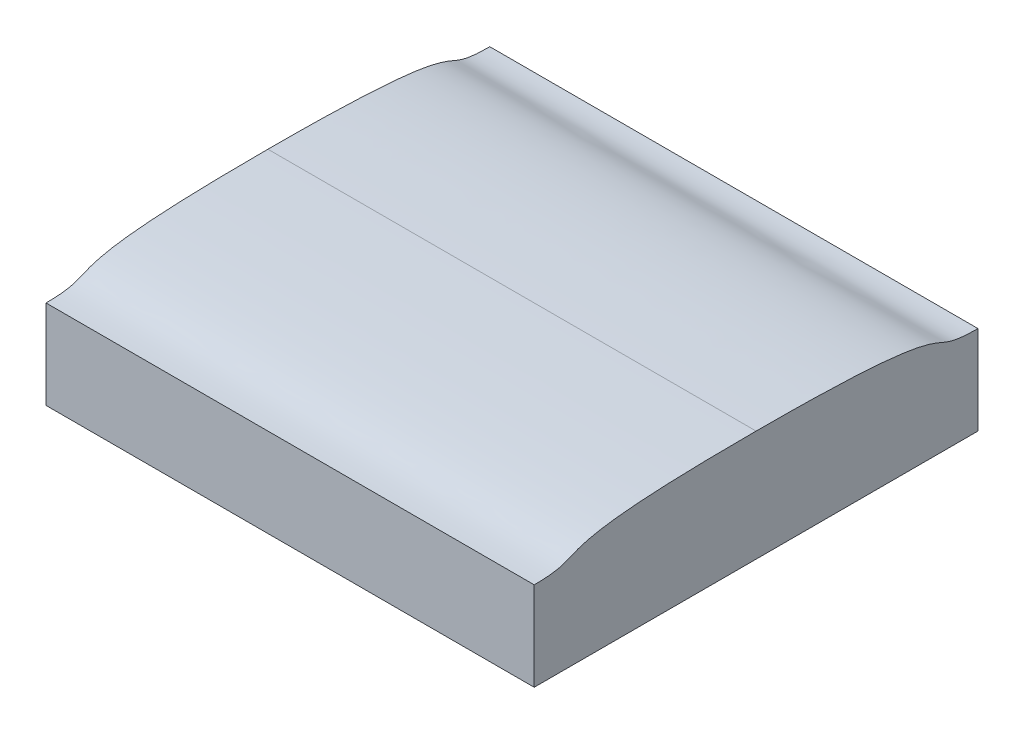
ISO-10303-21;
HEADER;
FILE_DESCRIPTION(('STEP AP214'),'2;1');
FILE_NAME('part.step','',(''),(''),'','','');
FILE_SCHEMA(('AUTOMOTIVE_DESIGN { 1 0 10303 214 1 1 1 1 }'));
ENDSEC;
DATA;
#1=APPLICATION_CONTEXT('core data for automotive mechanical design processes');
#2=APPLICATION_PROTOCOL_DEFINITION('international standard','automotive_design',2000,#1);
#3=PRODUCT_CONTEXT('',#1,'mechanical');
#4=PRODUCT('Part','Part','',(#3));
#5=PRODUCT_RELATED_PRODUCT_CATEGORY('part','',(#4));
#6=PRODUCT_DEFINITION_FORMATION('','',#4);
#7=PRODUCT_DEFINITION_CONTEXT('part definition',#1,'design');
#8=PRODUCT_DEFINITION('design','',#6,#7);
#9=PRODUCT_DEFINITION_SHAPE('','',#8);
#10=(LENGTH_UNIT() NAMED_UNIT(*) SI_UNIT(.MILLI.,.METRE.));
#11=(NAMED_UNIT(*) PLANE_ANGLE_UNIT() SI_UNIT($,.RADIAN.));
#12=(NAMED_UNIT(*) SI_UNIT($,.STERADIAN.) SOLID_ANGLE_UNIT());
#13=UNCERTAINTY_MEASURE_WITH_UNIT(LENGTH_MEASURE(1.E-05),#10,'distance_accuracy_value','');
#14=(GEOMETRIC_REPRESENTATION_CONTEXT(3) GLOBAL_UNCERTAINTY_ASSIGNED_CONTEXT((#13)) GLOBAL_UNIT_ASSIGNED_CONTEXT((#10,
#11,#12)) REPRESENTATION_CONTEXT('',''));
#15=CARTESIAN_POINT('',(0.,0.,0.));
#16=DIRECTION('',(0.,0.,1.));
#17=DIRECTION('',(1.,0.,0.));
#18=AXIS2_PLACEMENT_3D('',#15,#16,#17);
#19=CARTESIAN_POINT('',(22.,-0.230657832531694,-10.));
#20=DIRECTION('',(0.,0.,1.));
#21=DIRECTION('',(0.,-1.,0.));
#22=AXIS2_PLACEMENT_3D('',#19,#20,#21);
#23=PLANE('',#22);
#24=DIRECTION('',(0.,1.,0.));
#25=VECTOR('',#24,1.);
#26=CARTESIAN_POINT('',(0.,-0.230657832531694,-10.));
#27=LINE('',#26,#25);
#28=CARTESIAN_POINT('',(0.,-0.230657832531694,-10.));
#29=VERTEX_POINT('',#28);
#30=CARTESIAN_POINT('',(0.,3.76934216746831,-10.));
#31=VERTEX_POINT('',#30);
#32=EDGE_CURVE('E129',#29,#31,#27,.T.);
#33=ORIENTED_EDGE('',*,*,#32,.T.);
#34=DIRECTION('',(-1.,0.,0.));
#35=VECTOR('',#34,1.);
#36=CARTESIAN_POINT('',(22.,3.76934216746831,-10.));
#37=LINE('',#36,#35);
#38=CARTESIAN_POINT('',(22.,3.76934216746831,-10.));
#39=VERTEX_POINT('',#38);
#40=EDGE_CURVE('E41',#39,#31,#37,.T.);
#41=ORIENTED_EDGE('',*,*,#40,.F.);
#42=DIRECTION('',(0.,1.,0.));
#43=VECTOR('',#42,1.);
#44=CARTESIAN_POINT('',(22.,-0.230657832531694,-10.));
#45=LINE('',#44,#43);
#46=CARTESIAN_POINT('',(22.,-0.230657832531694,-10.));
#47=VERTEX_POINT('',#46);
#48=EDGE_CURVE('E87',#47,#39,#45,.T.);
#49=ORIENTED_EDGE('',*,*,#48,.F.);
#50=DIRECTION('',(-1.,0.,0.));
#51=VECTOR('',#50,1.);
#52=CARTESIAN_POINT('',(22.,-0.230657832531694,-10.));
#53=LINE('',#52,#51);
#54=EDGE_CURVE('E11',#47,#29,#53,.T.);
#55=ORIENTED_EDGE('',*,*,#54,.T.);
#56=EDGE_LOOP('',(#33,#41,#49,#55));
#57=FACE_BOUND('',#56,.T.);
#58=ADVANCED_FACE('F33',(#57),#23,.F.);
#59=CARTESIAN_POINT('',(22.,3.76934216746831,-10.));
#60=CARTESIAN_POINT('',(22.,3.76934216746831,-7.16012925192827));
#61=CARTESIAN_POINT('',(22.,4.76934216746831,-10.1680616594772));
#62=CARTESIAN_POINT('',(22.,4.76934216746831,0.));
#63=B_SPLINE_CURVE_WITH_KNOTS('',3,(#59,#60,#61,#62),.UNSPECIFIED.,.F.,.F.,(4,4),(0.,1.),.UNSPECIFIED.);
#64=DIRECTION('',(-1.,0.,0.));
#65=VECTOR('',#64,1.);
#66=SURFACE_OF_LINEAR_EXTRUSION('',#63,#65);
#67=CARTESIAN_POINT('',(0.,3.76934216746831,-10.));
#68=CARTESIAN_POINT('',(0.,3.76934216746831,-7.16012925192827));
#69=CARTESIAN_POINT('',(0.,4.76934216746831,-10.1680616594772));
#70=CARTESIAN_POINT('',(0.,4.76934216746831,0.));
#71=B_SPLINE_CURVE_WITH_KNOTS('',3,(#67,#68,#69,#70),.UNSPECIFIED.,.F.,.F.,(4,4),(0.,1.),.UNSPECIFIED.);
#72=CARTESIAN_POINT('',(0.,4.76934216746831,0.));
#73=VERTEX_POINT('',#72);
#74=EDGE_CURVE('E134',#31,#73,#71,.T.);
#75=ORIENTED_EDGE('',*,*,#74,.T.);
#76=DIRECTION('',(-1.,0.,0.));
#77=VECTOR('',#76,1.);
#78=CARTESIAN_POINT('',(22.,4.76934216746831,0.));
#79=LINE('',#78,#77);
#80=CARTESIAN_POINT('',(22.,4.76934216746831,0.));
#81=VERTEX_POINT('',#80);
#82=EDGE_CURVE('E109',#81,#73,#79,.T.);
#83=ORIENTED_EDGE('',*,*,#82,.F.);
#84=EDGE_CURVE('E100',#39,#81,#63,.T.);
#85=ORIENTED_EDGE('',*,*,#84,.F.);
#86=ORIENTED_EDGE('',*,*,#40,.T.);
#87=EDGE_LOOP('',(#75,#83,#85,#86));
#88=FACE_BOUND('',#87,.T.);
#89=ADVANCED_FACE('F159',(#88),#66,.F.);
#90=CARTESIAN_POINT('',(22.,4.76934216746831,0.));
#91=CARTESIAN_POINT('',(22.,4.76934216746831,10.1680616594772));
#92=CARTESIAN_POINT('',(22.,3.76934216746831,7.16012925192827));
#93=CARTESIAN_POINT('',(22.,3.76934216746831,10.));
#94=B_SPLINE_CURVE_WITH_KNOTS('',3,(#90,#91,#92,#93),.UNSPECIFIED.,.F.,.F.,(4,4),(0.,1.),.UNSPECIFIED.);
#95=DIRECTION('',(-1.,0.,0.));
#96=VECTOR('',#95,1.);
#97=SURFACE_OF_LINEAR_EXTRUSION('',#94,#96);
#98=CARTESIAN_POINT('',(0.,4.76934216746831,0.));
#99=CARTESIAN_POINT('',(0.,4.76934216746831,10.1680616594772));
#100=CARTESIAN_POINT('',(0.,3.76934216746831,7.16012925192827));
#101=CARTESIAN_POINT('',(0.,3.76934216746831,10.));
#102=B_SPLINE_CURVE_WITH_KNOTS('',3,(#98,#99,#100,#101),.UNSPECIFIED.,.F.,.F.,(4,4),(0.,1.),.UNSPECIFIED.);
#103=CARTESIAN_POINT('',(0.,3.76934216746831,10.));
#104=VERTEX_POINT('',#103);
#105=EDGE_CURVE('E108',#73,#104,#102,.T.);
#106=ORIENTED_EDGE('',*,*,#105,.T.);
#107=DIRECTION('',(-1.,0.,0.));
#108=VECTOR('',#107,1.);
#109=CARTESIAN_POINT('',(22.,3.76934216746831,10.));
#110=LINE('',#109,#108);
#111=CARTESIAN_POINT('',(22.,3.76934216746831,10.));
#112=VERTEX_POINT('',#111);
#113=EDGE_CURVE('E105',#112,#104,#110,.T.);
#114=ORIENTED_EDGE('',*,*,#113,.F.);
#115=EDGE_CURVE('E94',#81,#112,#94,.T.);
#116=ORIENTED_EDGE('',*,*,#115,.F.);
#117=ORIENTED_EDGE('',*,*,#82,.T.);
#118=EDGE_LOOP('',(#106,#114,#116,#117));
#119=FACE_BOUND('',#118,.T.);
#120=ADVANCED_FACE('F106',(#119),#97,.F.);
#121=CARTESIAN_POINT('',(22.,-0.230657832531694,10.));
#122=DIRECTION('',(0.,0.,-1.));
#123=DIRECTION('',(0.,1.,0.));
#124=AXIS2_PLACEMENT_3D('',#121,#122,#123);
#125=PLANE('',#124);
#126=DIRECTION('',(0.,-1.,0.));
#127=VECTOR('',#126,1.);
#128=CARTESIAN_POINT('',(0.,-0.230657832531694,10.));
#129=LINE('',#128,#127);
#130=CARTESIAN_POINT('',(0.,-0.230657832531694,10.));
#131=VERTEX_POINT('',#130);
#132=EDGE_CURVE('E72',#104,#131,#129,.T.);
#133=ORIENTED_EDGE('',*,*,#132,.T.);
#134=DIRECTION('',(-1.,0.,0.));
#135=VECTOR('',#134,1.);
#136=CARTESIAN_POINT('',(22.,-0.230657832531694,10.));
#137=LINE('',#136,#135);
#138=CARTESIAN_POINT('',(22.,-0.230657832531694,10.));
#139=VERTEX_POINT('',#138);
#140=EDGE_CURVE('E110',#139,#131,#137,.T.);
#141=ORIENTED_EDGE('',*,*,#140,.F.);
#142=DIRECTION('',(0.,-1.,0.));
#143=VECTOR('',#142,1.);
#144=CARTESIAN_POINT('',(22.,-0.230657832531694,10.));
#145=LINE('',#144,#143);
#146=EDGE_CURVE('E98',#112,#139,#145,.T.);
#147=ORIENTED_EDGE('',*,*,#146,.F.);
#148=ORIENTED_EDGE('',*,*,#113,.T.);
#149=EDGE_LOOP('',(#133,#141,#147,#148));
#150=FACE_BOUND('',#149,.T.);
#151=ADVANCED_FACE('F112',(#150),#125,.F.);
#152=CARTESIAN_POINT('',(22.,-0.230657832531694,10.));
#153=DIRECTION('',(0.,1.,0.));
#154=DIRECTION('',(0.,0.,1.));
#155=AXIS2_PLACEMENT_3D('',#152,#153,#154);
#156=PLANE('',#155);
#157=CARTESIAN_POINT('',(0.,-0.230657832531694,10.));
#158=CARTESIAN_POINT('',(0.,-0.230657832531695,5.3898885197977));
#159=CARTESIAN_POINT('',(0.,-0.230657832531693,8.66909228599614));
#160=CARTESIAN_POINT('',(0.,-0.230657832531693,0.));
#161=B_SPLINE_CURVE_WITH_KNOTS('',3,(#157,#158,#159,#160),.UNSPECIFIED.,.F.,.F.,(4,4),(0.,1.),.UNSPECIFIED.);
#162=CARTESIAN_POINT('',(0.,-0.230657832531693,0.));
#163=VERTEX_POINT('',#162);
#164=EDGE_CURVE('E79',#131,#163,#161,.T.);
#165=ORIENTED_EDGE('',*,*,#164,.T.);
#166=CARTESIAN_POINT('',(0.,-0.230657832531693,0.));
#167=CARTESIAN_POINT('',(0.,-0.230657832531693,-8.66909228599614));
#168=CARTESIAN_POINT('',(0.,-0.230657832531695,-5.38988851979771));
#169=CARTESIAN_POINT('',(0.,-0.230657832531694,-10.));
#170=B_SPLINE_CURVE_WITH_KNOTS('',3,(#166,#167,#168,#169),.UNSPECIFIED.,.F.,.F.,(4,4),(0.,1.),.UNSPECIFIED.);
#171=EDGE_CURVE('E122',#163,#29,#170,.T.);
#172=ORIENTED_EDGE('',*,*,#171,.T.);
#173=ORIENTED_EDGE('',*,*,#54,.F.);
#174=CARTESIAN_POINT('',(22.,-0.230657832531693,0.));
#175=CARTESIAN_POINT('',(22.,-0.230657832531693,-8.66909228599614));
#176=CARTESIAN_POINT('',(22.,-0.230657832531695,-5.38988851979771));
#177=CARTESIAN_POINT('',(22.,-0.230657832531694,-10.));
#178=B_SPLINE_CURVE_WITH_KNOTS('',3,(#174,#175,#176,#177),.UNSPECIFIED.,.F.,.F.,(4,4),(0.,1.),.UNSPECIFIED.);
#179=CARTESIAN_POINT('',(22.,-0.230657832531693,0.));
#180=VERTEX_POINT('',#179);
#181=EDGE_CURVE('E151',#180,#47,#178,.T.);
#182=ORIENTED_EDGE('',*,*,#181,.F.);
#183=CARTESIAN_POINT('',(22.,-0.230657832531694,10.));
#184=CARTESIAN_POINT('',(22.,-0.230657832531695,5.3898885197977));
#185=CARTESIAN_POINT('',(22.,-0.230657832531693,8.66909228599614));
#186=CARTESIAN_POINT('',(22.,-0.230657832531693,0.));
#187=B_SPLINE_CURVE_WITH_KNOTS('',3,(#183,#184,#185,#186),.UNSPECIFIED.,.F.,.F.,(4,4),(0.,1.),.UNSPECIFIED.);
#188=EDGE_CURVE('E49',#139,#180,#187,.T.);
#189=ORIENTED_EDGE('',*,*,#188,.F.);
#190=ORIENTED_EDGE('',*,*,#140,.T.);
#191=EDGE_LOOP('',(#165,#172,#173,#182,#189,#190));
#192=FACE_BOUND('',#191,.T.);
#193=ADVANCED_FACE('F163',(#192),#156,.F.);
#194=CARTESIAN_POINT('',(22.,4.26934216746831,7.74807159177707));
#195=DIRECTION('',(-1.,0.,0.));
#196=DIRECTION('',(0.,0.,1.));
#197=AXIS2_PLACEMENT_3D('',#194,#195,#196);
#198=PLANE('',#197);
#199=ORIENTED_EDGE('',*,*,#181,.T.);
#200=ORIENTED_EDGE('',*,*,#48,.T.);
#201=ORIENTED_EDGE('',*,*,#84,.T.);
#202=ORIENTED_EDGE('',*,*,#115,.T.);
#203=ORIENTED_EDGE('',*,*,#146,.T.);
#204=ORIENTED_EDGE('',*,*,#188,.T.);
#205=EDGE_LOOP('',(#199,#200,#201,#202,#203,#204));
#206=FACE_BOUND('',#205,.T.);
#207=ADVANCED_FACE('F96',(#206),#198,.F.);
#208=CARTESIAN_POINT('',(0.,4.26934216746831,7.74807159177707));
#209=DIRECTION('',(-1.,0.,0.));
#210=DIRECTION('',(0.,0.,1.));
#211=AXIS2_PLACEMENT_3D('',#208,#209,#210);
#212=PLANE('',#211);
#213=ORIENTED_EDGE('',*,*,#171,.F.);
#214=ORIENTED_EDGE('',*,*,#164,.F.);
#215=ORIENTED_EDGE('',*,*,#132,.F.);
#216=ORIENTED_EDGE('',*,*,#105,.F.);
#217=ORIENTED_EDGE('',*,*,#74,.F.);
#218=ORIENTED_EDGE('',*,*,#32,.F.);
#219=EDGE_LOOP('',(#213,#214,#215,#216,#217,#218));
#220=FACE_BOUND('',#219,.T.);
#221=ADVANCED_FACE('F161',(#220),#212,.T.);
#222=CLOSED_SHELL('',(#58,#89,#120,#151,#193,#207,#221));
#223=MANIFOLD_SOLID_BREP('B2',#222);
#224=ADVANCED_BREP_SHAPE_REPRESENTATION('',(#18,#223),#14);
#225=SHAPE_DEFINITION_REPRESENTATION(#9,#224);
ENDSEC;
END-ISO-10303-21;
